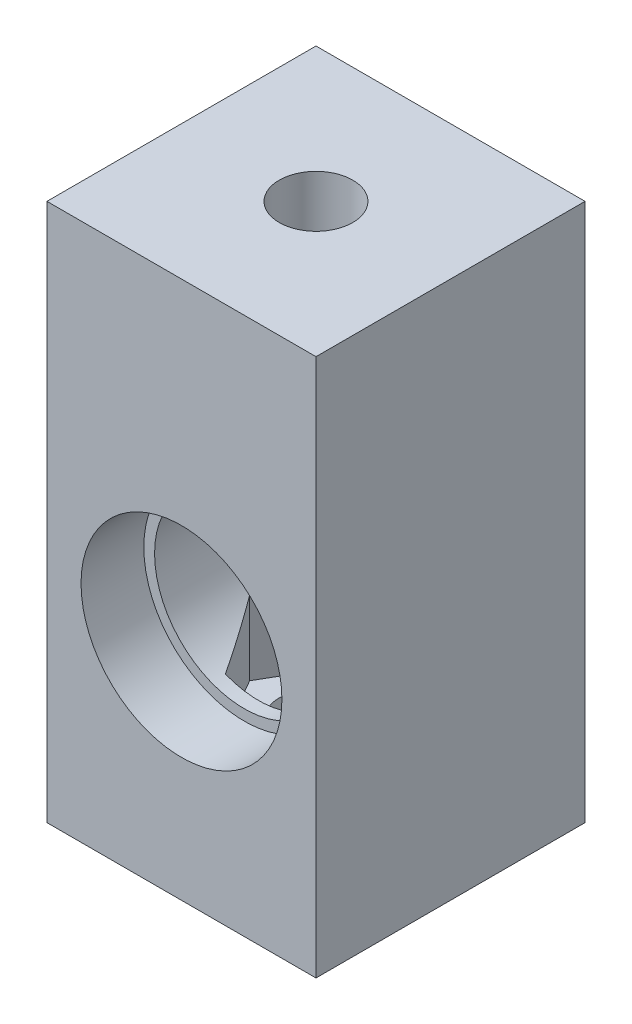
ISO-10303-21;
HEADER;
FILE_DESCRIPTION(('STEP AP214'),'2;1');
FILE_NAME('part.step','',(''),(''),'','','');
FILE_SCHEMA(('AUTOMOTIVE_DESIGN { 1 0 10303 214 1 1 1 1 }'));
ENDSEC;
DATA;
#1=APPLICATION_CONTEXT('core data for automotive mechanical design processes');
#2=APPLICATION_PROTOCOL_DEFINITION('international standard','automotive_design',2000,#1);
#3=PRODUCT_CONTEXT('',#1,'mechanical');
#4=PRODUCT('Part','Part','',(#3));
#5=PRODUCT_RELATED_PRODUCT_CATEGORY('part','',(#4));
#6=PRODUCT_DEFINITION_FORMATION('','',#4);
#7=PRODUCT_DEFINITION_CONTEXT('part definition',#1,'design');
#8=PRODUCT_DEFINITION('design','',#6,#7);
#9=PRODUCT_DEFINITION_SHAPE('','',#8);
#10=(LENGTH_UNIT() NAMED_UNIT(*) SI_UNIT(.MILLI.,.METRE.));
#11=(NAMED_UNIT(*) PLANE_ANGLE_UNIT() SI_UNIT($,.RADIAN.));
#12=(NAMED_UNIT(*) SI_UNIT($,.STERADIAN.) SOLID_ANGLE_UNIT());
#13=UNCERTAINTY_MEASURE_WITH_UNIT(LENGTH_MEASURE(1.E-05),#10,'distance_accuracy_value','');
#14=(GEOMETRIC_REPRESENTATION_CONTEXT(3) GLOBAL_UNCERTAINTY_ASSIGNED_CONTEXT((#13)) GLOBAL_UNIT_ASSIGNED_CONTEXT((#10,
#11,#12)) REPRESENTATION_CONTEXT('',''));
#15=CARTESIAN_POINT('',(0.,0.,0.));
#16=DIRECTION('',(0.,0.,1.));
#17=DIRECTION('',(1.,0.,0.));
#18=AXIS2_PLACEMENT_3D('',#15,#16,#17);
#19=CARTESIAN_POINT('',(0.,0.,0.));
#20=DIRECTION('',(0.,1.,0.));
#21=DIRECTION('',(0.,0.,1.));
#22=AXIS2_PLACEMENT_3D('',#19,#20,#21);
#23=CYLINDRICAL_SURFACE('',#22,4.1);
#24=CARTESIAN_POINT('',(0.,0.,0.));
#25=DIRECTION('',(0.,1.,0.));
#26=DIRECTION('',(0.,0.,1.));
#27=AXIS2_PLACEMENT_3D('',#24,#25,#26);
#28=CIRCLE('',#27,4.1);
#29=CARTESIAN_POINT('',(0.,0.,4.10000000000001));
#30=VERTEX_POINT('',#29);
#31=EDGE_CURVE('E214',#30,#30,#28,.T.);
#32=ORIENTED_EDGE('',*,*,#31,.F.);
#33=EDGE_LOOP('',(#32));
#34=FACE_BOUND('',#33,.T.);
#35=CARTESIAN_POINT('',(0.,10.,0.));
#36=DIRECTION('',(0.,1.,0.));
#37=DIRECTION('',(0.,0.,1.));
#38=AXIS2_PLACEMENT_3D('',#35,#36,#37);
#39=CIRCLE('',#38,4.1);
#40=CARTESIAN_POINT('',(0.,10.,4.10000000000001));
#41=VERTEX_POINT('',#40);
#42=EDGE_CURVE('E199',#41,#41,#39,.F.);
#43=ORIENTED_EDGE('',*,*,#42,.F.);
#44=EDGE_LOOP('',(#43));
#45=FACE_BOUND('',#44,.T.);
#46=ADVANCED_FACE('F35',(#34,#45),#23,.F.);
#47=CARTESIAN_POINT('',(0.,25.,-15.));
#48=DIRECTION('',(0.,0.,1.));
#49=DIRECTION('',(1.,0.,0.));
#50=AXIS2_PLACEMENT_3D('',#47,#48,#49);
#51=CYLINDRICAL_SURFACE('',#50,10.);
#52=CARTESIAN_POINT('',(0.,25.,-12.8171759760096));
#53=DIRECTION('',(-0.866025403784439,0.,-0.5));
#54=DIRECTION('',(-0.5,0.,0.866025403784439));
#55=AXIS2_PLACEMENT_3D('',#52,#53,#54);
#56=ELLIPSE('',#55,20.,10.);
#57=CARTESIAN_POINT('',(-7.39999999999996,18.2739313116799,0.));
#58=VERTEX_POINT('',#57);
#59=CARTESIAN_POINT('',(-3.69999999999996,15.7096824596788,-6.40858798800484));
#60=VERTEX_POINT('',#59);
#61=EDGE_CURVE('E274',#58,#60,#56,.F.);
#62=ORIENTED_EDGE('',*,*,#61,.T.);
#63=CARTESIAN_POINT('',(0.,25.,-6.40858798800484));
#64=DIRECTION('',(0.,0.,-1.));
#65=DIRECTION('',(-1.,0.,0.));
#66=AXIS2_PLACEMENT_3D('',#63,#64,#65);
#67=CIRCLE('',#66,10.);
#68=CARTESIAN_POINT('',(3.70000000000004,15.7096824596788,-6.40858798800484));
#69=VERTEX_POINT('',#68);
#70=EDGE_CURVE('E11',#60,#69,#67,.F.);
#71=ORIENTED_EDGE('',*,*,#70,.T.);
#72=CARTESIAN_POINT('',(0.,25.,-12.8171759760097));
#73=DIRECTION('',(0.866025403784438,0.,-0.5));
#74=DIRECTION('',(0.5,0.,0.866025403784439));
#75=AXIS2_PLACEMENT_3D('',#72,#73,#74);
#76=ELLIPSE('',#75,20.,10.);
#77=CARTESIAN_POINT('',(7.40000000000004,18.2739313116799,0.));
#78=VERTEX_POINT('',#77);
#79=EDGE_CURVE('E44',#69,#78,#76,.F.);
#80=ORIENTED_EDGE('',*,*,#79,.T.);
#81=CARTESIAN_POINT('',(0.,25.,12.8171759760098));
#82=DIRECTION('',(0.866025403784439,0.,0.5));
#83=DIRECTION('',(-0.5,0.,0.866025403784439));
#84=AXIS2_PLACEMENT_3D('',#81,#82,#83);
#85=ELLIPSE('',#84,20.,10.);
#86=CARTESIAN_POINT('',(3.70000000000004,15.7096824596788,6.40858798800486));
#87=VERTEX_POINT('',#86);
#88=EDGE_CURVE('E285',#78,#87,#85,.F.);
#89=ORIENTED_EDGE('',*,*,#88,.T.);
#90=CARTESIAN_POINT('',(0.,25.,6.40858798800486));
#91=DIRECTION('',(0.,0.,1.));
#92=DIRECTION('',(1.,0.,0.));
#93=AXIS2_PLACEMENT_3D('',#90,#91,#92);
#94=CIRCLE('',#93,10.);
#95=CARTESIAN_POINT('',(-3.69999999999996,15.7096824596788,6.40858798800486));
#96=VERTEX_POINT('',#95);
#97=EDGE_CURVE('E282',#87,#96,#94,.F.);
#98=ORIENTED_EDGE('',*,*,#97,.T.);
#99=CARTESIAN_POINT('',(0.,25.,12.8171759760096));
#100=DIRECTION('',(-0.866025403784438,0.,0.5));
#101=DIRECTION('',(0.5,0.,0.866025403784439));
#102=AXIS2_PLACEMENT_3D('',#99,#100,#101);
#103=ELLIPSE('',#102,20.,10.);
#104=EDGE_CURVE('E278',#96,#58,#103,.F.);
#105=ORIENTED_EDGE('',*,*,#104,.T.);
#106=EDGE_LOOP('',(#62,#71,#80,#89,#98,#105));
#107=FACE_BOUND('',#106,.T.);
#108=CARTESIAN_POINT('',(7.40000000000004,31.7260686883201,0.));
#109=VERTEX_POINT('',#108);
#110=CARTESIAN_POINT('',(3.70000000000004,34.2903175403212,-6.40858798800484));
#111=VERTEX_POINT('',#110);
#112=EDGE_CURVE('E284',#109,#111,#76,.F.);
#113=ORIENTED_EDGE('',*,*,#112,.T.);
#114=CARTESIAN_POINT('',(-3.69999999999996,34.2903175403212,-6.40858798800484));
#115=VERTEX_POINT('',#114);
#116=EDGE_CURVE('E39',#111,#115,#67,.F.);
#117=ORIENTED_EDGE('',*,*,#116,.T.);
#118=CARTESIAN_POINT('',(-7.39999999999996,31.7260686883201,0.));
#119=VERTEX_POINT('',#118);
#120=EDGE_CURVE('E264',#115,#119,#56,.F.);
#121=ORIENTED_EDGE('',*,*,#120,.T.);
#122=CARTESIAN_POINT('',(-3.69999999999996,34.2903175403212,6.40858798800486));
#123=VERTEX_POINT('',#122);
#124=EDGE_CURVE('E273',#119,#123,#103,.F.);
#125=ORIENTED_EDGE('',*,*,#124,.T.);
#126=CARTESIAN_POINT('',(3.70000000000004,34.2903175403212,6.40858798800486));
#127=VERTEX_POINT('',#126);
#128=EDGE_CURVE('E277',#123,#127,#94,.F.);
#129=ORIENTED_EDGE('',*,*,#128,.T.);
#130=EDGE_CURVE('E281',#127,#109,#85,.F.);
#131=ORIENTED_EDGE('',*,*,#130,.T.);
#132=EDGE_LOOP('',(#113,#117,#121,#125,#129,#131));
#133=FACE_BOUND('',#132,.T.);
#134=CARTESIAN_POINT('',(0.,25.,-15.));
#135=DIRECTION('',(0.,0.,1.));
#136=DIRECTION('',(1.,0.,0.));
#137=AXIS2_PLACEMENT_3D('',#134,#135,#136);
#138=CIRCLE('',#137,10.);
#139=CARTESIAN_POINT('',(10.,25.,-15.));
#140=VERTEX_POINT('',#139);
#141=EDGE_CURVE('E240',#140,#140,#138,.T.);
#142=ORIENTED_EDGE('',*,*,#141,.F.);
#143=EDGE_LOOP('',(#142));
#144=FACE_BOUND('',#143,.T.);
#145=CARTESIAN_POINT('',(0.,25.,8.00000000000001));
#146=DIRECTION('',(0.,0.,1.));
#147=DIRECTION('',(1.,0.,0.));
#148=AXIS2_PLACEMENT_3D('',#145,#146,#147);
#149=CIRCLE('',#148,10.);
#150=CARTESIAN_POINT('',(10.,25.,8.00000000000001));
#151=VERTEX_POINT('',#150);
#152=EDGE_CURVE('E237',#151,#151,#149,.F.);
#153=ORIENTED_EDGE('',*,*,#152,.F.);
#154=EDGE_LOOP('',(#153));
#155=FACE_BOUND('',#154,.T.);
#156=ADVANCED_FACE('F294',(#107,#133,#144,#155),#51,.F.);
#157=CARTESIAN_POINT('',(-15.,50.,15.));
#158=DIRECTION('',(1.,0.,0.));
#159=DIRECTION('',(0.,0.,-1.));
#160=AXIS2_PLACEMENT_3D('',#157,#158,#159);
#161=PLANE('',#160);
#162=DIRECTION('',(0.,0.,1.));
#163=VECTOR('',#162,1.);
#164=CARTESIAN_POINT('',(-15.,0.,15.));
#165=LINE('',#164,#163);
#166=CARTESIAN_POINT('',(-15.,0.,-15.));
#167=VERTEX_POINT('',#166);
#168=CARTESIAN_POINT('',(-15.,0.,15.));
#169=VERTEX_POINT('',#168);
#170=EDGE_CURVE('E243',#167,#169,#165,.T.);
#171=ORIENTED_EDGE('',*,*,#170,.T.);
#172=DIRECTION('',(0.,-1.,0.));
#173=VECTOR('',#172,1.);
#174=CARTESIAN_POINT('',(-15.,50.,15.));
#175=LINE('',#174,#173);
#176=CARTESIAN_POINT('',(-15.,60.,15.));
#177=VERTEX_POINT('',#176);
#178=EDGE_CURVE('E261',#177,#169,#175,.T.);
#179=ORIENTED_EDGE('',*,*,#178,.F.);
#180=DIRECTION('',(0.,0.,1.));
#181=VECTOR('',#180,1.);
#182=CARTESIAN_POINT('',(-15.,60.,15.));
#183=LINE('',#182,#181);
#184=CARTESIAN_POINT('',(-15.,60.,-15.));
#185=VERTEX_POINT('',#184);
#186=EDGE_CURVE('E217',#185,#177,#183,.T.);
#187=ORIENTED_EDGE('',*,*,#186,.F.);
#188=DIRECTION('',(0.,-1.,0.));
#189=VECTOR('',#188,1.);
#190=CARTESIAN_POINT('',(-15.,50.,-15.));
#191=LINE('',#190,#189);
#192=EDGE_CURVE('E252',#185,#167,#191,.T.);
#193=ORIENTED_EDGE('',*,*,#192,.T.);
#194=EDGE_LOOP('',(#171,#179,#187,#193));
#195=FACE_BOUND('',#194,.T.);
#196=ADVANCED_FACE('F37',(#195),#161,.F.);
#197=CARTESIAN_POINT('',(15.,50.,15.));
#198=DIRECTION('',(0.,0.,-1.));
#199=DIRECTION('',(-1.,0.,0.));
#200=AXIS2_PLACEMENT_3D('',#197,#198,#199);
#201=PLANE('',#200);
#202=CARTESIAN_POINT('',(0.,25.,15.));
#203=DIRECTION('',(0.,0.,1.));
#204=DIRECTION('',(1.,0.,0.));
#205=AXIS2_PLACEMENT_3D('',#202,#203,#204);
#206=CIRCLE('',#205,11.2);
#207=CARTESIAN_POINT('',(11.2,25.,15.));
#208=VERTEX_POINT('',#207);
#209=EDGE_CURVE('E233',#208,#208,#206,.T.);
#210=ORIENTED_EDGE('',*,*,#209,.F.);
#211=EDGE_LOOP('',(#210));
#212=FACE_BOUND('',#211,.T.);
#213=DIRECTION('',(1.,0.,0.));
#214=VECTOR('',#213,1.);
#215=CARTESIAN_POINT('',(15.,0.,15.));
#216=LINE('',#215,#214);
#217=CARTESIAN_POINT('',(15.,0.,15.));
#218=VERTEX_POINT('',#217);
#219=EDGE_CURVE('E246',#169,#218,#216,.T.);
#220=ORIENTED_EDGE('',*,*,#219,.T.);
#221=DIRECTION('',(0.,-1.,0.));
#222=VECTOR('',#221,1.);
#223=CARTESIAN_POINT('',(15.,50.,15.));
#224=LINE('',#223,#222);
#225=CARTESIAN_POINT('',(15.,60.,15.));
#226=VERTEX_POINT('',#225);
#227=EDGE_CURVE('E258',#226,#218,#224,.T.);
#228=ORIENTED_EDGE('',*,*,#227,.F.);
#229=DIRECTION('',(1.,0.,0.));
#230=VECTOR('',#229,1.);
#231=CARTESIAN_POINT('',(15.,60.,15.));
#232=LINE('',#231,#230);
#233=EDGE_CURVE('E224',#177,#226,#232,.T.);
#234=ORIENTED_EDGE('',*,*,#233,.F.);
#235=ORIENTED_EDGE('',*,*,#178,.T.);
#236=EDGE_LOOP('',(#220,#228,#234,#235));
#237=FACE_BOUND('',#236,.T.);
#238=ADVANCED_FACE('F351',(#212,#237),#201,.F.);
#239=CARTESIAN_POINT('',(15.,50.,15.));
#240=DIRECTION('',(-1.,0.,0.));
#241=DIRECTION('',(0.,0.,1.));
#242=AXIS2_PLACEMENT_3D('',#239,#240,#241);
#243=PLANE('',#242);
#244=DIRECTION('',(0.,0.,-1.));
#245=VECTOR('',#244,1.);
#246=CARTESIAN_POINT('',(15.,0.,15.));
#247=LINE('',#246,#245);
#248=CARTESIAN_POINT('',(15.,0.,-15.));
#249=VERTEX_POINT('',#248);
#250=EDGE_CURVE('E248',#218,#249,#247,.T.);
#251=ORIENTED_EDGE('',*,*,#250,.T.);
#252=DIRECTION('',(0.,-1.,0.));
#253=VECTOR('',#252,1.);
#254=CARTESIAN_POINT('',(15.,50.,-15.));
#255=LINE('',#254,#253);
#256=CARTESIAN_POINT('',(15.,60.,-15.));
#257=VERTEX_POINT('',#256);
#258=EDGE_CURVE('E255',#257,#249,#255,.T.);
#259=ORIENTED_EDGE('',*,*,#258,.F.);
#260=DIRECTION('',(0.,0.,-1.));
#261=VECTOR('',#260,1.);
#262=CARTESIAN_POINT('',(15.,60.,15.));
#263=LINE('',#262,#261);
#264=EDGE_CURVE('E227',#226,#257,#263,.T.);
#265=ORIENTED_EDGE('',*,*,#264,.F.);
#266=ORIENTED_EDGE('',*,*,#227,.T.);
#267=EDGE_LOOP('',(#251,#259,#265,#266));
#268=FACE_BOUND('',#267,.T.);
#269=ADVANCED_FACE('F354',(#268),#243,.F.);
#270=CARTESIAN_POINT('',(15.,50.,-15.));
#271=DIRECTION('',(0.,0.,1.));
#272=DIRECTION('',(1.,0.,0.));
#273=AXIS2_PLACEMENT_3D('',#270,#271,#272);
#274=PLANE('',#273);
#275=ORIENTED_EDGE('',*,*,#141,.T.);
#276=EDGE_LOOP('',(#275));
#277=FACE_BOUND('',#276,.T.);
#278=DIRECTION('',(-1.,0.,0.));
#279=VECTOR('',#278,1.);
#280=CARTESIAN_POINT('',(15.,0.,-15.));
#281=LINE('',#280,#279);
#282=EDGE_CURVE('E250',#249,#167,#281,.T.);
#283=ORIENTED_EDGE('',*,*,#282,.T.);
#284=ORIENTED_EDGE('',*,*,#192,.F.);
#285=DIRECTION('',(-1.,0.,0.));
#286=VECTOR('',#285,1.);
#287=CARTESIAN_POINT('',(15.,60.,-15.));
#288=LINE('',#287,#286);
#289=EDGE_CURVE('E230',#257,#185,#288,.T.);
#290=ORIENTED_EDGE('',*,*,#289,.F.);
#291=ORIENTED_EDGE('',*,*,#258,.T.);
#292=EDGE_LOOP('',(#283,#284,#290,#291));
#293=FACE_BOUND('',#292,.T.);
#294=ADVANCED_FACE('F359',(#277,#293),#274,.F.);
#295=CARTESIAN_POINT('',(0.,0.,0.));
#296=DIRECTION('',(0.,1.,0.));
#297=DIRECTION('',(0.,0.,1.));
#298=AXIS2_PLACEMENT_3D('',#295,#296,#297);
#299=PLANE('',#298);
#300=ORIENTED_EDGE('',*,*,#31,.T.);
#301=EDGE_LOOP('',(#300));
#302=FACE_BOUND('',#301,.T.);
#303=ORIENTED_EDGE('',*,*,#170,.F.);
#304=ORIENTED_EDGE('',*,*,#282,.F.);
#305=ORIENTED_EDGE('',*,*,#250,.F.);
#306=ORIENTED_EDGE('',*,*,#219,.F.);
#307=EDGE_LOOP('',(#303,#304,#305,#306));
#308=FACE_BOUND('',#307,.T.);
#309=ADVANCED_FACE('F357',(#302,#308),#299,.F.);
#310=CARTESIAN_POINT('',(0.,25.,8.00000000000001));
#311=DIRECTION('',(0.,0.,1.));
#312=DIRECTION('',(1.,0.,0.));
#313=AXIS2_PLACEMENT_3D('',#310,#311,#312);
#314=PLANE('',#313);
#315=CARTESIAN_POINT('',(0.,25.,8.00000000000001));
#316=DIRECTION('',(0.,0.,1.));
#317=DIRECTION('',(1.,0.,0.));
#318=AXIS2_PLACEMENT_3D('',#315,#316,#317);
#319=CIRCLE('',#318,11.2);
#320=CARTESIAN_POINT('',(11.2,25.,8.00000000000001));
#321=VERTEX_POINT('',#320);
#322=EDGE_CURVE('E234',#321,#321,#319,.T.);
#323=ORIENTED_EDGE('',*,*,#322,.T.);
#324=EDGE_LOOP('',(#323));
#325=FACE_BOUND('',#324,.T.);
#326=ORIENTED_EDGE('',*,*,#152,.T.);
#327=EDGE_LOOP('',(#326));
#328=FACE_BOUND('',#327,.T.);
#329=ADVANCED_FACE('F367',(#325,#328),#314,.T.);
#330=CARTESIAN_POINT('',(0.,25.,8.00000000000001));
#331=DIRECTION('',(0.,0.,1.));
#332=DIRECTION('',(1.,0.,0.));
#333=AXIS2_PLACEMENT_3D('',#330,#331,#332);
#334=CYLINDRICAL_SURFACE('',#333,11.2);
#335=ORIENTED_EDGE('',*,*,#322,.F.);
#336=EDGE_LOOP('',(#335));
#337=FACE_BOUND('',#336,.T.);
#338=ORIENTED_EDGE('',*,*,#209,.T.);
#339=EDGE_LOOP('',(#338));
#340=FACE_BOUND('',#339,.T.);
#341=ADVANCED_FACE('F338',(#337,#340),#334,.F.);
#342=CARTESIAN_POINT('',(0.,60.,0.));
#343=DIRECTION('',(0.,1.,0.));
#344=DIRECTION('',(0.,0.,1.));
#345=AXIS2_PLACEMENT_3D('',#342,#343,#344);
#346=PLANE('',#345);
#347=CARTESIAN_POINT('',(0.,60.,0.));
#348=DIRECTION('',(0.,1.,0.));
#349=DIRECTION('',(0.,0.,1.));
#350=AXIS2_PLACEMENT_3D('',#347,#348,#349);
#351=CIRCLE('',#350,4.1);
#352=CARTESIAN_POINT('',(0.,60.,4.10000000000001));
#353=VERTEX_POINT('',#352);
#354=EDGE_CURVE('E218',#353,#353,#351,.T.);
#355=ORIENTED_EDGE('',*,*,#354,.F.);
#356=EDGE_LOOP('',(#355));
#357=FACE_BOUND('',#356,.T.);
#358=ORIENTED_EDGE('',*,*,#186,.T.);
#359=ORIENTED_EDGE('',*,*,#233,.T.);
#360=ORIENTED_EDGE('',*,*,#264,.T.);
#361=ORIENTED_EDGE('',*,*,#289,.T.);
#362=EDGE_LOOP('',(#358,#359,#360,#361));
#363=FACE_BOUND('',#362,.T.);
#364=ADVANCED_FACE('F331',(#357,#363),#346,.T.);
#365=CARTESIAN_POINT('',(0.,40.,0.));
#366=DIRECTION('',(0.,1.,0.));
#367=DIRECTION('',(0.,0.,1.));
#368=AXIS2_PLACEMENT_3D('',#365,#366,#367);
#369=CIRCLE('',#368,4.1);
#370=CARTESIAN_POINT('',(0.,40.,4.10000000000001));
#371=VERTEX_POINT('',#370);
#372=EDGE_CURVE('E221',#371,#371,#369,.F.);
#373=ORIENTED_EDGE('',*,*,#372,.T.);
#374=EDGE_LOOP('',(#373));
#375=FACE_BOUND('',#374,.T.);
#376=ORIENTED_EDGE('',*,*,#354,.T.);
#377=EDGE_LOOP('',(#376));
#378=FACE_BOUND('',#377,.T.);
#379=ADVANCED_FACE('F322',(#375,#378),#23,.F.);
#380=CARTESIAN_POINT('',(0.,10.,0.));
#381=DIRECTION('',(0.,1.,0.));
#382=DIRECTION('',(0.,0.,1.));
#383=AXIS2_PLACEMENT_3D('',#380,#381,#382);
#384=PLANE('',#383);
#385=DIRECTION('',(-1.,0.,0.));
#386=VECTOR('',#385,1.);
#387=CARTESIAN_POINT('',(3.70000000000004,10.,-6.40858798800484));
#388=LINE('',#387,#386);
#389=CARTESIAN_POINT('',(3.70000000000004,10.,-6.40858798800484));
#390=VERTEX_POINT('',#389);
#391=CARTESIAN_POINT('',(-3.69999999999996,10.,-6.40858798800484));
#392=VERTEX_POINT('',#391);
#393=EDGE_CURVE('E151',#390,#392,#388,.T.);
#394=ORIENTED_EDGE('',*,*,#393,.T.);
#395=DIRECTION('',(-0.5,0.,0.866025403784439));
#396=VECTOR('',#395,1.);
#397=CARTESIAN_POINT('',(-3.69999999999996,10.,-6.40858798800484));
#398=LINE('',#397,#396);
#399=CARTESIAN_POINT('',(-7.39999999999996,10.,0.));
#400=VERTEX_POINT('',#399);
#401=EDGE_CURVE('E157',#392,#400,#398,.T.);
#402=ORIENTED_EDGE('',*,*,#401,.T.);
#403=DIRECTION('',(0.5,0.,0.866025403784438));
#404=VECTOR('',#403,1.);
#405=CARTESIAN_POINT('',(-7.39999999999996,10.,0.));
#406=LINE('',#405,#404);
#407=CARTESIAN_POINT('',(-3.69999999999996,10.,6.40858798800486));
#408=VERTEX_POINT('',#407);
#409=EDGE_CURVE('E164',#400,#408,#406,.T.);
#410=ORIENTED_EDGE('',*,*,#409,.T.);
#411=DIRECTION('',(1.,0.,0.));
#412=VECTOR('',#411,1.);
#413=CARTESIAN_POINT('',(-3.69999999999996,10.,6.40858798800486));
#414=LINE('',#413,#412);
#415=CARTESIAN_POINT('',(3.70000000000004,10.,6.40858798800486));
#416=VERTEX_POINT('',#415);
#417=EDGE_CURVE('E178',#408,#416,#414,.T.);
#418=ORIENTED_EDGE('',*,*,#417,.T.);
#419=DIRECTION('',(0.5,0.,-0.866025403784439));
#420=VECTOR('',#419,1.);
#421=CARTESIAN_POINT('',(3.70000000000004,10.,6.40858798800486));
#422=LINE('',#421,#420);
#423=CARTESIAN_POINT('',(7.40000000000004,10.,0.));
#424=VERTEX_POINT('',#423);
#425=EDGE_CURVE('E181',#416,#424,#422,.T.);
#426=ORIENTED_EDGE('',*,*,#425,.T.);
#427=DIRECTION('',(-0.5,0.,-0.866025403784438));
#428=VECTOR('',#427,1.);
#429=CARTESIAN_POINT('',(7.40000000000004,10.,0.));
#430=LINE('',#429,#428);
#431=EDGE_CURVE('E170',#424,#390,#430,.T.);
#432=ORIENTED_EDGE('',*,*,#431,.T.);
#433=EDGE_LOOP('',(#394,#402,#410,#418,#426,#432));
#434=FACE_BOUND('',#433,.T.);
#435=ORIENTED_EDGE('',*,*,#42,.T.);
#436=EDGE_LOOP('',(#435));
#437=FACE_BOUND('',#436,.T.);
#438=ADVANCED_FACE('F166',(#434,#437),#384,.T.);
#439=CARTESIAN_POINT('',(-3.69999999999996,10.,-6.40858798800484));
#440=DIRECTION('',(-0.866025403784439,0.,-0.5));
#441=DIRECTION('',(-0.5,0.,0.866025403784439));
#442=AXIS2_PLACEMENT_3D('',#439,#440,#441);
#443=PLANE('',#442);
#444=DIRECTION('',(0.,1.,0.));
#445=VECTOR('',#444,1.);
#446=CARTESIAN_POINT('',(-7.39999999999996,10.,0.));
#447=LINE('',#446,#445);
#448=EDGE_CURVE('E160',#400,#58,#447,.T.);
#449=ORIENTED_EDGE('',*,*,#448,.F.);
#450=ORIENTED_EDGE('',*,*,#401,.F.);
#451=DIRECTION('',(0.,1.,0.));
#452=VECTOR('',#451,1.);
#453=CARTESIAN_POINT('',(-3.69999999999996,10.,-6.40858798800484));
#454=LINE('',#453,#452);
#455=EDGE_CURVE('E51',#392,#60,#454,.T.);
#456=ORIENTED_EDGE('',*,*,#455,.T.);
#457=ORIENTED_EDGE('',*,*,#61,.F.);
#458=EDGE_LOOP('',(#449,#450,#456,#457));
#459=FACE_BOUND('',#458,.T.);
#460=ADVANCED_FACE('F158',(#459),#443,.F.);
#461=CARTESIAN_POINT('',(-7.39999999999996,10.,0.));
#462=DIRECTION('',(-0.866025403784438,0.,0.5));
#463=DIRECTION('',(0.5,0.,0.866025403784439));
#464=AXIS2_PLACEMENT_3D('',#461,#462,#463);
#465=PLANE('',#464);
#466=DIRECTION('',(0.,1.,0.));
#467=VECTOR('',#466,1.);
#468=CARTESIAN_POINT('',(-3.69999999999996,10.,6.40858798800486));
#469=LINE('',#468,#467);
#470=EDGE_CURVE('E209',#408,#96,#469,.T.);
#471=ORIENTED_EDGE('',*,*,#470,.F.);
#472=ORIENTED_EDGE('',*,*,#409,.F.);
#473=ORIENTED_EDGE('',*,*,#448,.T.);
#474=ORIENTED_EDGE('',*,*,#104,.F.);
#475=EDGE_LOOP('',(#471,#472,#473,#474));
#476=FACE_BOUND('',#475,.T.);
#477=ADVANCED_FACE('F296',(#476),#465,.F.);
#478=CARTESIAN_POINT('',(-3.69999999999996,10.,6.40858798800486));
#479=DIRECTION('',(0.,0.,1.));
#480=DIRECTION('',(1.,0.,0.));
#481=AXIS2_PLACEMENT_3D('',#478,#479,#480);
#482=PLANE('',#481);
#483=DIRECTION('',(0.,1.,0.));
#484=VECTOR('',#483,1.);
#485=CARTESIAN_POINT('',(3.70000000000004,10.,6.40858798800486));
#486=LINE('',#485,#484);
#487=EDGE_CURVE('E205',#416,#87,#486,.T.);
#488=ORIENTED_EDGE('',*,*,#487,.F.);
#489=ORIENTED_EDGE('',*,*,#417,.F.);
#490=ORIENTED_EDGE('',*,*,#470,.T.);
#491=ORIENTED_EDGE('',*,*,#97,.F.);
#492=EDGE_LOOP('',(#488,#489,#490,#491));
#493=FACE_BOUND('',#492,.T.);
#494=ADVANCED_FACE('F300',(#493),#482,.F.);
#495=CARTESIAN_POINT('',(3.70000000000004,10.,6.40858798800486));
#496=DIRECTION('',(0.866025403784439,0.,0.5));
#497=DIRECTION('',(0.5,0.,-0.866025403784439));
#498=AXIS2_PLACEMENT_3D('',#495,#496,#497);
#499=PLANE('',#498);
#500=DIRECTION('',(0.,1.,0.));
#501=VECTOR('',#500,1.);
#502=CARTESIAN_POINT('',(7.40000000000004,10.,0.));
#503=LINE('',#502,#501);
#504=EDGE_CURVE('E201',#424,#78,#503,.T.);
#505=ORIENTED_EDGE('',*,*,#504,.F.);
#506=ORIENTED_EDGE('',*,*,#425,.F.);
#507=ORIENTED_EDGE('',*,*,#487,.T.);
#508=ORIENTED_EDGE('',*,*,#88,.F.);
#509=EDGE_LOOP('',(#505,#506,#507,#508));
#510=FACE_BOUND('',#509,.T.);
#511=ADVANCED_FACE('F302',(#510),#499,.F.);
#512=CARTESIAN_POINT('',(7.40000000000004,10.,0.));
#513=DIRECTION('',(0.866025403784438,0.,-0.5));
#514=DIRECTION('',(-0.5,0.,-0.866025403784439));
#515=AXIS2_PLACEMENT_3D('',#512,#513,#514);
#516=PLANE('',#515);
#517=DIRECTION('',(0.,1.,0.));
#518=VECTOR('',#517,1.);
#519=CARTESIAN_POINT('',(3.70000000000004,10.,-6.40858798800484));
#520=LINE('',#519,#518);
#521=EDGE_CURVE('E197',#390,#69,#520,.T.);
#522=ORIENTED_EDGE('',*,*,#521,.F.);
#523=ORIENTED_EDGE('',*,*,#431,.F.);
#524=ORIENTED_EDGE('',*,*,#504,.T.);
#525=ORIENTED_EDGE('',*,*,#79,.F.);
#526=EDGE_LOOP('',(#522,#523,#524,#525));
#527=FACE_BOUND('',#526,.T.);
#528=ADVANCED_FACE('F304',(#527),#516,.F.);
#529=CARTESIAN_POINT('',(3.70000000000004,10.,-6.40858798800484));
#530=DIRECTION('',(0.,0.,-1.));
#531=DIRECTION('',(-1.,0.,0.));
#532=AXIS2_PLACEMENT_3D('',#529,#530,#531);
#533=PLANE('',#532);
#534=ORIENTED_EDGE('',*,*,#455,.F.);
#535=ORIENTED_EDGE('',*,*,#393,.F.);
#536=ORIENTED_EDGE('',*,*,#521,.T.);
#537=ORIENTED_EDGE('',*,*,#70,.F.);
#538=EDGE_LOOP('',(#534,#535,#536,#537));
#539=FACE_BOUND('',#538,.T.);
#540=ADVANCED_FACE('F148',(#539),#533,.F.);
#541=CARTESIAN_POINT('',(3.70000000000004,40.,-6.40858798800484));
#542=VERTEX_POINT('',#541);
#543=EDGE_CURVE('E200',#111,#542,#520,.T.);
#544=ORIENTED_EDGE('',*,*,#543,.T.);
#545=DIRECTION('',(-1.,0.,0.));
#546=VECTOR('',#545,1.);
#547=CARTESIAN_POINT('',(3.70000000000004,40.,-6.40858798800484));
#548=LINE('',#547,#546);
#549=CARTESIAN_POINT('',(-3.69999999999996,40.,-6.40858798800484));
#550=VERTEX_POINT('',#549);
#551=EDGE_CURVE('E184',#542,#550,#548,.T.);
#552=ORIENTED_EDGE('',*,*,#551,.T.);
#553=EDGE_CURVE('E154',#115,#550,#454,.T.);
#554=ORIENTED_EDGE('',*,*,#553,.F.);
#555=ORIENTED_EDGE('',*,*,#116,.F.);
#556=EDGE_LOOP('',(#544,#552,#554,#555));
#557=FACE_BOUND('',#556,.T.);
#558=ADVANCED_FACE('F312',(#557),#533,.F.);
#559=CARTESIAN_POINT('',(7.40000000000004,40.,0.));
#560=VERTEX_POINT('',#559);
#561=EDGE_CURVE('E204',#109,#560,#503,.T.);
#562=ORIENTED_EDGE('',*,*,#561,.T.);
#563=DIRECTION('',(-0.5,0.,-0.866025403784438));
#564=VECTOR('',#563,1.);
#565=CARTESIAN_POINT('',(7.40000000000004,40.,0.));
#566=LINE('',#565,#564);
#567=EDGE_CURVE('E171',#560,#542,#566,.T.);
#568=ORIENTED_EDGE('',*,*,#567,.T.);
#569=ORIENTED_EDGE('',*,*,#543,.F.);
#570=ORIENTED_EDGE('',*,*,#112,.F.);
#571=EDGE_LOOP('',(#562,#568,#569,#570));
#572=FACE_BOUND('',#571,.T.);
#573=ADVANCED_FACE('F307',(#572),#516,.F.);
#574=CARTESIAN_POINT('',(3.70000000000004,40.,6.40858798800486));
#575=VERTEX_POINT('',#574);
#576=EDGE_CURVE('E208',#127,#575,#486,.T.);
#577=ORIENTED_EDGE('',*,*,#576,.T.);
#578=DIRECTION('',(0.5,0.,-0.866025403784439));
#579=VECTOR('',#578,1.);
#580=CARTESIAN_POINT('',(3.70000000000004,40.,6.40858798800486));
#581=LINE('',#580,#579);
#582=EDGE_CURVE('E174',#575,#560,#581,.T.);
#583=ORIENTED_EDGE('',*,*,#582,.T.);
#584=ORIENTED_EDGE('',*,*,#561,.F.);
#585=ORIENTED_EDGE('',*,*,#130,.F.);
#586=EDGE_LOOP('',(#577,#583,#584,#585));
#587=FACE_BOUND('',#586,.T.);
#588=ADVANCED_FACE('F315',(#587),#499,.F.);
#589=CARTESIAN_POINT('',(-3.69999999999996,40.,6.40858798800486));
#590=VERTEX_POINT('',#589);
#591=EDGE_CURVE('E212',#123,#590,#469,.T.);
#592=ORIENTED_EDGE('',*,*,#591,.T.);
#593=DIRECTION('',(1.,0.,0.));
#594=VECTOR('',#593,1.);
#595=CARTESIAN_POINT('',(-3.69999999999996,40.,6.40858798800486));
#596=LINE('',#595,#594);
#597=EDGE_CURVE('E192',#590,#575,#596,.T.);
#598=ORIENTED_EDGE('',*,*,#597,.T.);
#599=ORIENTED_EDGE('',*,*,#576,.F.);
#600=ORIENTED_EDGE('',*,*,#128,.F.);
#601=EDGE_LOOP('',(#592,#598,#599,#600));
#602=FACE_BOUND('',#601,.T.);
#603=ADVANCED_FACE('F454',(#602),#482,.F.);
#604=CARTESIAN_POINT('',(-7.39999999999996,40.,0.));
#605=VERTEX_POINT('',#604);
#606=EDGE_CURVE('E59',#119,#605,#447,.T.);
#607=ORIENTED_EDGE('',*,*,#606,.T.);
#608=DIRECTION('',(0.5,0.,0.866025403784438));
#609=VECTOR('',#608,1.);
#610=CARTESIAN_POINT('',(-7.39999999999996,40.,0.));
#611=LINE('',#610,#609);
#612=EDGE_CURVE('E189',#605,#590,#611,.T.);
#613=ORIENTED_EDGE('',*,*,#612,.T.);
#614=ORIENTED_EDGE('',*,*,#591,.F.);
#615=ORIENTED_EDGE('',*,*,#124,.F.);
#616=EDGE_LOOP('',(#607,#613,#614,#615));
#617=FACE_BOUND('',#616,.T.);
#618=ADVANCED_FACE('F445',(#617),#465,.F.);
#619=ORIENTED_EDGE('',*,*,#553,.T.);
#620=DIRECTION('',(-0.5,0.,0.866025403784439));
#621=VECTOR('',#620,1.);
#622=CARTESIAN_POINT('',(-3.69999999999996,40.,-6.40858798800484));
#623=LINE('',#622,#621);
#624=EDGE_CURVE('E187',#550,#605,#623,.T.);
#625=ORIENTED_EDGE('',*,*,#624,.T.);
#626=ORIENTED_EDGE('',*,*,#606,.F.);
#627=ORIENTED_EDGE('',*,*,#120,.F.);
#628=EDGE_LOOP('',(#619,#625,#626,#627));
#629=FACE_BOUND('',#628,.T.);
#630=ADVANCED_FACE('F436',(#629),#443,.F.);
#631=CARTESIAN_POINT('',(0.,40.,0.));
#632=DIRECTION('',(0.,1.,0.));
#633=DIRECTION('',(0.,0.,1.));
#634=AXIS2_PLACEMENT_3D('',#631,#632,#633);
#635=PLANE('',#634);
#636=ORIENTED_EDGE('',*,*,#551,.F.);
#637=ORIENTED_EDGE('',*,*,#567,.F.);
#638=ORIENTED_EDGE('',*,*,#582,.F.);
#639=ORIENTED_EDGE('',*,*,#597,.F.);
#640=ORIENTED_EDGE('',*,*,#612,.F.);
#641=ORIENTED_EDGE('',*,*,#624,.F.);
#642=EDGE_LOOP('',(#636,#637,#638,#639,#640,#641));
#643=FACE_BOUND('',#642,.T.);
#644=ORIENTED_EDGE('',*,*,#372,.F.);
#645=EDGE_LOOP('',(#644));
#646=FACE_BOUND('',#645,.T.);
#647=ADVANCED_FACE('F516',(#643,#646),#635,.F.);
#648=CLOSED_SHELL('',(#46,#156,#196,#238,#269,#294,#309,#329,#341,#364,#379,#438,#460,#477,#494,
#511,#528,#540,#558,#573,#588,#603,#618,#630,#647));
#649=MANIFOLD_SOLID_BREP('B2',#648);
#650=ADVANCED_BREP_SHAPE_REPRESENTATION('',(#18,#649),#14);
#651=SHAPE_DEFINITION_REPRESENTATION(#9,#650);
ENDSEC;
END-ISO-10303-21;
